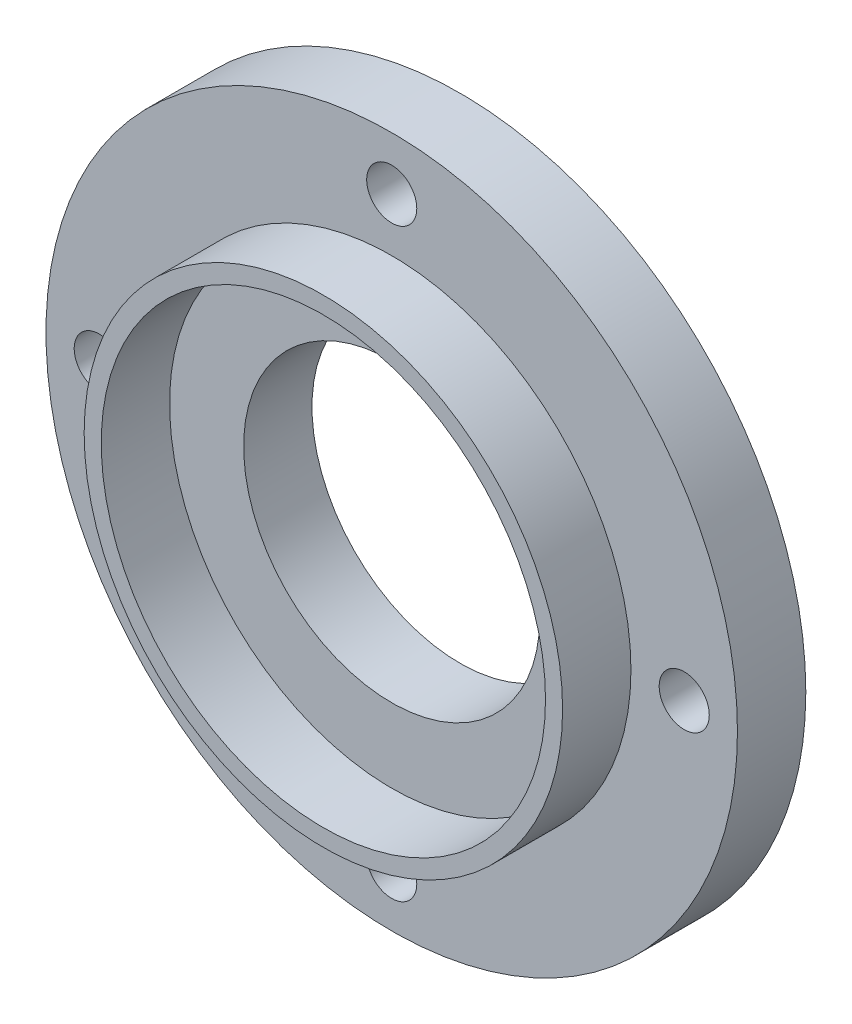
ISO-10303-21;
HEADER;
FILE_DESCRIPTION(('STEP AP214'),'2;1');
FILE_NAME('part.step','',(''),(''),'','','');
FILE_SCHEMA(('AUTOMOTIVE_DESIGN { 1 0 10303 214 1 1 1 1 }'));
ENDSEC;
DATA;
#1=APPLICATION_CONTEXT('core data for automotive mechanical design processes');
#2=APPLICATION_PROTOCOL_DEFINITION('international standard','automotive_design',2000,#1);
#3=PRODUCT_CONTEXT('',#1,'mechanical');
#4=PRODUCT('Part','Part','',(#3));
#5=PRODUCT_RELATED_PRODUCT_CATEGORY('part','',(#4));
#6=PRODUCT_DEFINITION_FORMATION('','',#4);
#7=PRODUCT_DEFINITION_CONTEXT('part definition',#1,'design');
#8=PRODUCT_DEFINITION('design','',#6,#7);
#9=PRODUCT_DEFINITION_SHAPE('','',#8);
#10=(LENGTH_UNIT() NAMED_UNIT(*) SI_UNIT(.MILLI.,.METRE.));
#11=(NAMED_UNIT(*) PLANE_ANGLE_UNIT() SI_UNIT($,.RADIAN.));
#12=(NAMED_UNIT(*) SI_UNIT($,.STERADIAN.) SOLID_ANGLE_UNIT());
#13=UNCERTAINTY_MEASURE_WITH_UNIT(LENGTH_MEASURE(1.E-05),#10,'distance_accuracy_value','');
#14=(GEOMETRIC_REPRESENTATION_CONTEXT(3) GLOBAL_UNCERTAINTY_ASSIGNED_CONTEXT((#13)) GLOBAL_UNIT_ASSIGNED_CONTEXT((#10,
#11,#12)) REPRESENTATION_CONTEXT('',''));
#15=CARTESIAN_POINT('',(0.,0.,0.));
#16=DIRECTION('',(0.,0.,1.));
#17=DIRECTION('',(1.,0.,0.));
#18=AXIS2_PLACEMENT_3D('',#15,#16,#17);
#19=CARTESIAN_POINT('',(0.,0.,3.));
#20=DIRECTION('',(0.,0.,1.));
#21=DIRECTION('',(1.,0.,0.));
#22=AXIS2_PLACEMENT_3D('',#19,#20,#21);
#23=PLANE('',#22);
#24=CARTESIAN_POINT('',(0.,0.,3.));
#25=DIRECTION('',(0.,0.,1.));
#26=DIRECTION('',(1.,0.,0.));
#27=AXIS2_PLACEMENT_3D('',#24,#25,#26);
#28=CIRCLE('',#27,6.5);
#29=CARTESIAN_POINT('',(6.5,0.,3.));
#30=VERTEX_POINT('',#29);
#31=EDGE_CURVE('E56',#30,#30,#28,.T.);
#32=ORIENTED_EDGE('',*,*,#31,.F.);
#33=EDGE_LOOP('',(#32));
#34=FACE_BOUND('',#33,.T.);
#35=CARTESIAN_POINT('',(0.,0.,3.));
#36=DIRECTION('',(0.,0.,1.));
#37=DIRECTION('',(1.,0.,0.));
#38=AXIS2_PLACEMENT_3D('',#35,#36,#37);
#39=CIRCLE('',#38,9.75);
#40=CARTESIAN_POINT('',(9.75,0.,3.));
#41=VERTEX_POINT('',#40);
#42=EDGE_CURVE('E10',#41,#41,#39,.F.);
#43=ORIENTED_EDGE('',*,*,#42,.F.);
#44=EDGE_LOOP('',(#43));
#45=FACE_BOUND('',#44,.T.);
#46=ADVANCED_FACE('F36',(#34,#45),#23,.T.);
#47=CARTESIAN_POINT('',(0.,12.8374999999999,3.));
#48=DIRECTION('',(0.,0.,1.));
#49=DIRECTION('',(1.,0.,0.));
#50=AXIS2_PLACEMENT_3D('',#47,#48,#49);
#51=CIRCLE('',#50,1.1);
#52=CARTESIAN_POINT('',(1.1,12.8374999999999,3.));
#53=VERTEX_POINT('',#52);
#54=EDGE_CURVE('E97',#53,#53,#51,.T.);
#55=ORIENTED_EDGE('',*,*,#54,.F.);
#56=EDGE_LOOP('',(#55));
#57=FACE_BOUND('',#56,.T.);
#58=CARTESIAN_POINT('',(-12.8375,0.,3.));
#59=DIRECTION('',(0.,0.,1.));
#60=DIRECTION('',(1.,0.,0.));
#61=AXIS2_PLACEMENT_3D('',#58,#59,#60);
#62=CIRCLE('',#61,1.1);
#63=CARTESIAN_POINT('',(-11.7375,0.,3.));
#64=VERTEX_POINT('',#63);
#65=EDGE_CURVE('E89',#64,#64,#62,.T.);
#66=ORIENTED_EDGE('',*,*,#65,.F.);
#67=EDGE_LOOP('',(#66));
#68=FACE_BOUND('',#67,.T.);
#69=CARTESIAN_POINT('',(0.,-12.8374999999999,3.));
#70=DIRECTION('',(0.,0.,1.));
#71=DIRECTION('',(1.,0.,0.));
#72=AXIS2_PLACEMENT_3D('',#69,#70,#71);
#73=CIRCLE('',#72,1.1);
#74=CARTESIAN_POINT('',(1.1,-12.8374999999999,3.));
#75=VERTEX_POINT('',#74);
#76=EDGE_CURVE('E81',#75,#75,#73,.T.);
#77=ORIENTED_EDGE('',*,*,#76,.F.);
#78=EDGE_LOOP('',(#77));
#79=FACE_BOUND('',#78,.T.);
#80=CARTESIAN_POINT('',(12.8375,0.,3.));
#81=DIRECTION('',(0.,0.,1.));
#82=DIRECTION('',(1.,0.,0.));
#83=AXIS2_PLACEMENT_3D('',#80,#81,#82);
#84=CIRCLE('',#83,1.1);
#85=CARTESIAN_POINT('',(13.9375,0.,3.));
#86=VERTEX_POINT('',#85);
#87=EDGE_CURVE('E40',#86,#86,#84,.T.);
#88=ORIENTED_EDGE('',*,*,#87,.F.);
#89=EDGE_LOOP('',(#88));
#90=FACE_BOUND('',#89,.T.);
#91=CARTESIAN_POINT('',(0.,0.,3.));
#92=DIRECTION('',(0.,0.,1.));
#93=DIRECTION('',(1.,0.,0.));
#94=AXIS2_PLACEMENT_3D('',#91,#92,#93);
#95=CIRCLE('',#94,10.5);
#96=CARTESIAN_POINT('',(10.5,0.,3.));
#97=VERTEX_POINT('',#96);
#98=EDGE_CURVE('E66',#97,#97,#95,.T.);
#99=ORIENTED_EDGE('',*,*,#98,.F.);
#100=EDGE_LOOP('',(#99));
#101=FACE_BOUND('',#100,.T.);
#102=CARTESIAN_POINT('',(0.,0.,3.));
#103=DIRECTION('',(0.,0.,1.));
#104=DIRECTION('',(1.,0.,0.));
#105=AXIS2_PLACEMENT_3D('',#102,#103,#104);
#106=CIRCLE('',#105,15.175);
#107=CARTESIAN_POINT('',(15.175,0.,3.));
#108=VERTEX_POINT('',#107);
#109=EDGE_CURVE('E45',#108,#108,#106,.T.);
#110=ORIENTED_EDGE('',*,*,#109,.T.);
#111=EDGE_LOOP('',(#110));
#112=FACE_BOUND('',#111,.T.);
#113=ADVANCED_FACE('F112',(#57,#68,#79,#90,#101,#112),#23,.T.);
#114=CARTESIAN_POINT('',(0.,0.,0.));
#115=DIRECTION('',(0.,0.,1.));
#116=DIRECTION('',(1.,0.,0.));
#117=AXIS2_PLACEMENT_3D('',#114,#115,#116);
#118=PLANE('',#117);
#119=CARTESIAN_POINT('',(0.,12.8374999999999,0.));
#120=DIRECTION('',(0.,0.,-1.));
#121=DIRECTION('',(-1.,0.,0.));
#122=AXIS2_PLACEMENT_3D('',#119,#120,#121);
#123=CIRCLE('',#122,1.1);
#124=CARTESIAN_POINT('',(-1.1,12.8374999999999,0.));
#125=VERTEX_POINT('',#124);
#126=EDGE_CURVE('E101',#125,#125,#123,.T.);
#127=ORIENTED_EDGE('',*,*,#126,.F.);
#128=EDGE_LOOP('',(#127));
#129=FACE_BOUND('',#128,.T.);
#130=CARTESIAN_POINT('',(-12.8375,0.,0.));
#131=DIRECTION('',(0.,0.,-1.));
#132=DIRECTION('',(-1.,0.,0.));
#133=AXIS2_PLACEMENT_3D('',#130,#131,#132);
#134=CIRCLE('',#133,1.1);
#135=CARTESIAN_POINT('',(-13.9375,0.,0.));
#136=VERTEX_POINT('',#135);
#137=EDGE_CURVE('E93',#136,#136,#134,.T.);
#138=ORIENTED_EDGE('',*,*,#137,.F.);
#139=EDGE_LOOP('',(#138));
#140=FACE_BOUND('',#139,.T.);
#141=CARTESIAN_POINT('',(0.,-12.8374999999999,0.));
#142=DIRECTION('',(0.,0.,-1.));
#143=DIRECTION('',(-1.,0.,0.));
#144=AXIS2_PLACEMENT_3D('',#141,#142,#143);
#145=CIRCLE('',#144,1.1);
#146=CARTESIAN_POINT('',(-1.1,-12.8374999999999,0.));
#147=VERTEX_POINT('',#146);
#148=EDGE_CURVE('E85',#147,#147,#145,.T.);
#149=ORIENTED_EDGE('',*,*,#148,.F.);
#150=EDGE_LOOP('',(#149));
#151=FACE_BOUND('',#150,.T.);
#152=CARTESIAN_POINT('',(12.8375,0.,0.));
#153=DIRECTION('',(0.,0.,-1.));
#154=DIRECTION('',(-1.,0.,0.));
#155=AXIS2_PLACEMENT_3D('',#152,#153,#154);
#156=CIRCLE('',#155,1.1);
#157=CARTESIAN_POINT('',(11.7375,0.,0.));
#158=VERTEX_POINT('',#157);
#159=EDGE_CURVE('E77',#158,#158,#156,.T.);
#160=ORIENTED_EDGE('',*,*,#159,.F.);
#161=EDGE_LOOP('',(#160));
#162=FACE_BOUND('',#161,.T.);
#163=CARTESIAN_POINT('',(0.,0.,0.));
#164=DIRECTION('',(0.,0.,1.));
#165=DIRECTION('',(1.,0.,0.));
#166=AXIS2_PLACEMENT_3D('',#163,#164,#165);
#167=CIRCLE('',#166,15.175);
#168=CARTESIAN_POINT('',(15.175,0.,0.));
#169=VERTEX_POINT('',#168);
#170=EDGE_CURVE('E51',#169,#169,#167,.T.);
#171=ORIENTED_EDGE('',*,*,#170,.F.);
#172=EDGE_LOOP('',(#171));
#173=FACE_BOUND('',#172,.T.);
#174=CARTESIAN_POINT('',(0.,0.,0.));
#175=DIRECTION('',(0.,0.,1.));
#176=DIRECTION('',(1.,0.,0.));
#177=AXIS2_PLACEMENT_3D('',#174,#175,#176);
#178=CIRCLE('',#177,6.5);
#179=CARTESIAN_POINT('',(6.5,0.,0.));
#180=VERTEX_POINT('',#179);
#181=EDGE_CURVE('E58',#180,#180,#178,.T.);
#182=ORIENTED_EDGE('',*,*,#181,.T.);
#183=EDGE_LOOP('',(#182));
#184=FACE_BOUND('',#183,.T.);
#185=ADVANCED_FACE('F109',(#129,#140,#151,#162,#173,#184),#118,.F.);
#186=CARTESIAN_POINT('',(0.,0.,3.));
#187=DIRECTION('',(0.,0.,-1.));
#188=DIRECTION('',(-1.,0.,0.));
#189=AXIS2_PLACEMENT_3D('',#186,#187,#188);
#190=CYLINDRICAL_SURFACE('',#189,15.175);
#191=ORIENTED_EDGE('',*,*,#109,.F.);
#192=EDGE_LOOP('',(#191));
#193=FACE_BOUND('',#192,.T.);
#194=ORIENTED_EDGE('',*,*,#170,.T.);
#195=EDGE_LOOP('',(#194));
#196=FACE_BOUND('',#195,.T.);
#197=ADVANCED_FACE('F38',(#193,#196),#190,.T.);
#198=CARTESIAN_POINT('',(0.,0.,3.));
#199=DIRECTION('',(0.,0.,-1.));
#200=DIRECTION('',(-1.,0.,0.));
#201=AXIS2_PLACEMENT_3D('',#198,#199,#200);
#202=CYLINDRICAL_SURFACE('',#201,6.5);
#203=ORIENTED_EDGE('',*,*,#31,.T.);
#204=EDGE_LOOP('',(#203));
#205=FACE_BOUND('',#204,.T.);
#206=ORIENTED_EDGE('',*,*,#181,.F.);
#207=EDGE_LOOP('',(#206));
#208=FACE_BOUND('',#207,.T.);
#209=ADVANCED_FACE('F123',(#205,#208),#202,.F.);
#210=CARTESIAN_POINT('',(0.,0.,6.));
#211=DIRECTION('',(0.,0.,1.));
#212=DIRECTION('',(1.,0.,0.));
#213=AXIS2_PLACEMENT_3D('',#210,#211,#212);
#214=PLANE('',#213);
#215=CARTESIAN_POINT('',(0.,0.,6.));
#216=DIRECTION('',(0.,0.,1.));
#217=DIRECTION('',(1.,0.,0.));
#218=AXIS2_PLACEMENT_3D('',#215,#216,#217);
#219=CIRCLE('',#218,10.5);
#220=CARTESIAN_POINT('',(10.5,0.,6.));
#221=VERTEX_POINT('',#220);
#222=EDGE_CURVE('E62',#221,#221,#219,.T.);
#223=ORIENTED_EDGE('',*,*,#222,.T.);
#224=EDGE_LOOP('',(#223));
#225=FACE_BOUND('',#224,.T.);
#226=CARTESIAN_POINT('',(0.,0.,6.));
#227=DIRECTION('',(0.,0.,1.));
#228=DIRECTION('',(1.,0.,0.));
#229=AXIS2_PLACEMENT_3D('',#226,#227,#228);
#230=CIRCLE('',#229,9.75);
#231=CARTESIAN_POINT('',(9.75,0.,6.));
#232=VERTEX_POINT('',#231);
#233=EDGE_CURVE('E70',#232,#232,#230,.T.);
#234=ORIENTED_EDGE('',*,*,#233,.F.);
#235=EDGE_LOOP('',(#234));
#236=FACE_BOUND('',#235,.T.);
#237=ADVANCED_FACE('F125',(#225,#236),#214,.T.);
#238=CARTESIAN_POINT('',(0.,0.,6.));
#239=DIRECTION('',(0.,0.,-1.));
#240=DIRECTION('',(-1.,0.,0.));
#241=AXIS2_PLACEMENT_3D('',#238,#239,#240);
#242=CYLINDRICAL_SURFACE('',#241,10.5);
#243=ORIENTED_EDGE('',*,*,#222,.F.);
#244=EDGE_LOOP('',(#243));
#245=FACE_BOUND('',#244,.T.);
#246=ORIENTED_EDGE('',*,*,#98,.T.);
#247=EDGE_LOOP('',(#246));
#248=FACE_BOUND('',#247,.T.);
#249=ADVANCED_FACE('F132',(#245,#248),#242,.T.);
#250=CARTESIAN_POINT('',(0.,0.,6.));
#251=DIRECTION('',(0.,0.,-1.));
#252=DIRECTION('',(-1.,0.,0.));
#253=AXIS2_PLACEMENT_3D('',#250,#251,#252);
#254=CYLINDRICAL_SURFACE('',#253,9.75);
#255=ORIENTED_EDGE('',*,*,#233,.T.);
#256=EDGE_LOOP('',(#255));
#257=FACE_BOUND('',#256,.T.);
#258=ORIENTED_EDGE('',*,*,#42,.T.);
#259=EDGE_LOOP('',(#258));
#260=FACE_BOUND('',#259,.T.);
#261=ADVANCED_FACE('F163',(#257,#260),#254,.F.);
#262=CARTESIAN_POINT('',(12.8375,0.,0.));
#263=DIRECTION('',(0.,0.,-1.));
#264=DIRECTION('',(-1.,0.,0.));
#265=AXIS2_PLACEMENT_3D('',#262,#263,#264);
#266=CYLINDRICAL_SURFACE('',#265,1.1);
#267=ORIENTED_EDGE('',*,*,#87,.T.);
#268=EDGE_LOOP('',(#267));
#269=FACE_BOUND('',#268,.T.);
#270=ORIENTED_EDGE('',*,*,#159,.T.);
#271=EDGE_LOOP('',(#270));
#272=FACE_BOUND('',#271,.T.);
#273=ADVANCED_FACE('F168',(#269,#272),#266,.F.);
#274=CARTESIAN_POINT('',(0.,-12.8374999999999,0.));
#275=DIRECTION('',(0.,0.,-1.));
#276=DIRECTION('',(-1.,0.,0.));
#277=AXIS2_PLACEMENT_3D('',#274,#275,#276);
#278=CYLINDRICAL_SURFACE('',#277,1.1);
#279=ORIENTED_EDGE('',*,*,#76,.T.);
#280=EDGE_LOOP('',(#279));
#281=FACE_BOUND('',#280,.T.);
#282=ORIENTED_EDGE('',*,*,#148,.T.);
#283=EDGE_LOOP('',(#282));
#284=FACE_BOUND('',#283,.T.);
#285=ADVANCED_FACE('F175',(#281,#284),#278,.F.);
#286=CARTESIAN_POINT('',(-12.8375,0.,0.));
#287=DIRECTION('',(0.,0.,-1.));
#288=DIRECTION('',(-1.,0.,0.));
#289=AXIS2_PLACEMENT_3D('',#286,#287,#288);
#290=CYLINDRICAL_SURFACE('',#289,1.1);
#291=ORIENTED_EDGE('',*,*,#65,.T.);
#292=EDGE_LOOP('',(#291));
#293=FACE_BOUND('',#292,.T.);
#294=ORIENTED_EDGE('',*,*,#137,.T.);
#295=EDGE_LOOP('',(#294));
#296=FACE_BOUND('',#295,.T.);
#297=ADVANCED_FACE('F179',(#293,#296),#290,.F.);
#298=CARTESIAN_POINT('',(0.,12.8374999999999,0.));
#299=DIRECTION('',(0.,0.,-1.));
#300=DIRECTION('',(-1.,0.,0.));
#301=AXIS2_PLACEMENT_3D('',#298,#299,#300);
#302=CYLINDRICAL_SURFACE('',#301,1.1);
#303=ORIENTED_EDGE('',*,*,#54,.T.);
#304=EDGE_LOOP('',(#303));
#305=FACE_BOUND('',#304,.T.);
#306=ORIENTED_EDGE('',*,*,#126,.T.);
#307=EDGE_LOOP('',(#306));
#308=FACE_BOUND('',#307,.T.);
#309=ADVANCED_FACE('F107',(#305,#308),#302,.F.);
#310=CLOSED_SHELL('',(#46,#113,#185,#197,#209,#237,#249,#261,#273,#285,#297,#309));
#311=MANIFOLD_SOLID_BREP('B2',#310);
#312=ADVANCED_BREP_SHAPE_REPRESENTATION('',(#18,#311),#14);
#313=SHAPE_DEFINITION_REPRESENTATION(#9,#312);
ENDSEC;
END-ISO-10303-21;
